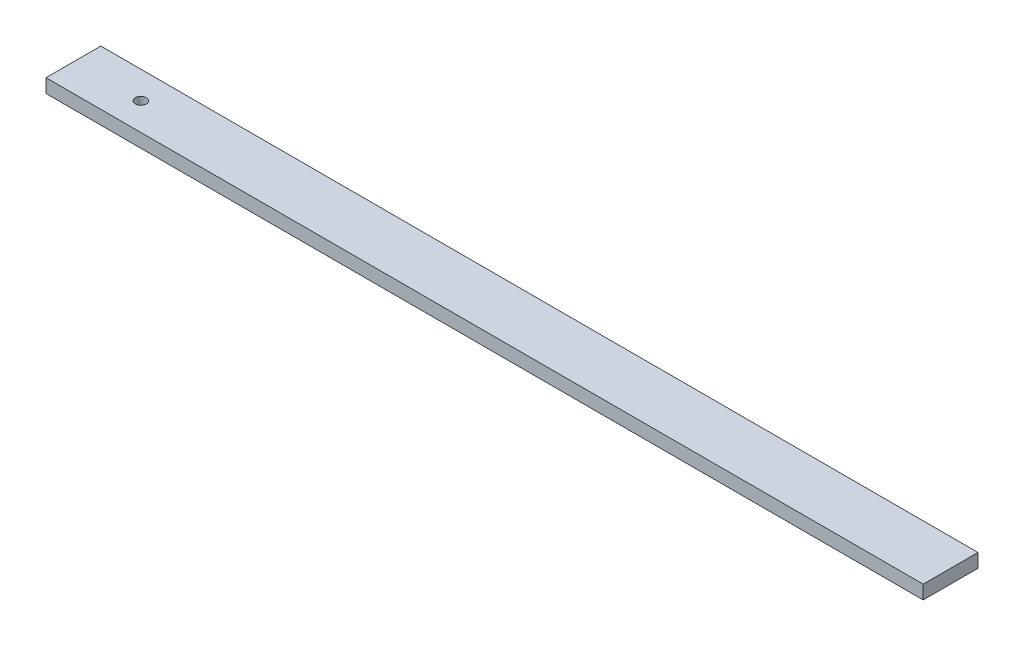
ISO-10303-21;
HEADER;
FILE_DESCRIPTION(('STEP AP214'),'2;1');
FILE_NAME('part.step','',(''),(''),'','','');
FILE_SCHEMA(('AUTOMOTIVE_DESIGN { 1 0 10303 214 1 1 1 1 }'));
ENDSEC;
DATA;
#1=APPLICATION_CONTEXT('core data for automotive mechanical design processes');
#2=APPLICATION_PROTOCOL_DEFINITION('international standard','automotive_design',2000,#1);
#3=PRODUCT_CONTEXT('',#1,'mechanical');
#4=PRODUCT('Part','Part','',(#3));
#5=PRODUCT_RELATED_PRODUCT_CATEGORY('part','',(#4));
#6=PRODUCT_DEFINITION_FORMATION('','',#4);
#7=PRODUCT_DEFINITION_CONTEXT('part definition',#1,'design');
#8=PRODUCT_DEFINITION('design','',#6,#7);
#9=PRODUCT_DEFINITION_SHAPE('','',#8);
#10=(LENGTH_UNIT() NAMED_UNIT(*) SI_UNIT(.MILLI.,.METRE.));
#11=(NAMED_UNIT(*) PLANE_ANGLE_UNIT() SI_UNIT($,.RADIAN.));
#12=(NAMED_UNIT(*) SI_UNIT($,.STERADIAN.) SOLID_ANGLE_UNIT());
#13=UNCERTAINTY_MEASURE_WITH_UNIT(LENGTH_MEASURE(1.E-05),#10,'distance_accuracy_value','');
#14=(GEOMETRIC_REPRESENTATION_CONTEXT(3) GLOBAL_UNCERTAINTY_ASSIGNED_CONTEXT((#13)) GLOBAL_UNIT_ASSIGNED_CONTEXT((#10,
#11,#12)) REPRESENTATION_CONTEXT('',''));
#15=CARTESIAN_POINT('',(0.,0.,0.));
#16=DIRECTION('',(0.,0.,1.));
#17=DIRECTION('',(1.,0.,0.));
#18=AXIS2_PLACEMENT_3D('',#15,#16,#17);
#19=CARTESIAN_POINT('',(211.2,-3.05,12.2));
#20=DIRECTION('',(0.,0.,-1.));
#21=DIRECTION('',(-1.,0.,0.));
#22=AXIS2_PLACEMENT_3D('',#19,#20,#21);
#23=PLANE('',#22);
#24=DIRECTION('',(0.,-1.,0.));
#25=VECTOR('',#24,1.);
#26=CARTESIAN_POINT('',(-195.2,-3.05,12.2));
#27=LINE('',#26,#25);
#28=CARTESIAN_POINT('',(-195.2,3.3,12.2));
#29=VERTEX_POINT('',#28);
#30=CARTESIAN_POINT('',(-195.2,-3.05,12.2));
#31=VERTEX_POINT('',#30);
#32=EDGE_CURVE('E97',#29,#31,#27,.T.);
#33=ORIENTED_EDGE('',*,*,#32,.T.);
#34=DIRECTION('',(-1.,0.,0.));
#35=VECTOR('',#34,1.);
#36=CARTESIAN_POINT('',(211.2,-3.05,12.2));
#37=LINE('',#36,#35);
#38=CARTESIAN_POINT('',(211.2,-3.05,12.2));
#39=VERTEX_POINT('',#38);
#40=EDGE_CURVE('E11',#39,#31,#37,.T.);
#41=ORIENTED_EDGE('',*,*,#40,.F.);
#42=DIRECTION('',(0.,-1.,0.));
#43=VECTOR('',#42,1.);
#44=CARTESIAN_POINT('',(211.2,-3.05,12.2));
#45=LINE('',#44,#43);
#46=CARTESIAN_POINT('',(211.2,3.3,12.2));
#47=VERTEX_POINT('',#46);
#48=EDGE_CURVE('E85',#47,#39,#45,.T.);
#49=ORIENTED_EDGE('',*,*,#48,.F.);
#50=DIRECTION('',(-1.,0.,0.));
#51=VECTOR('',#50,1.);
#52=CARTESIAN_POINT('',(211.2,3.3,12.2));
#53=LINE('',#52,#51);
#54=EDGE_CURVE('E93',#47,#29,#53,.T.);
#55=ORIENTED_EDGE('',*,*,#54,.T.);
#56=EDGE_LOOP('',(#33,#41,#49,#55));
#57=FACE_BOUND('',#56,.T.);
#58=ADVANCED_FACE('F34',(#57),#23,.F.);
#59=CARTESIAN_POINT('',(211.2,-3.05,12.2));
#60=DIRECTION('',(0.,1.,0.));
#61=DIRECTION('',(0.,0.,1.));
#62=AXIS2_PLACEMENT_3D('',#59,#60,#61);
#63=PLANE('',#62);
#64=CARTESIAN_POINT('',(-163.958,-3.05,-0.5));
#65=DIRECTION('',(0.,1.,0.));
#66=DIRECTION('',(0.,0.,1.));
#67=AXIS2_PLACEMENT_3D('',#64,#65,#66);
#68=CIRCLE('',#67,2.53999999999998);
#69=CARTESIAN_POINT('',(-163.958,-3.05,2.03999999999998));
#70=VERTEX_POINT('',#69);
#71=EDGE_CURVE('E100',#70,#70,#68,.T.);
#72=ORIENTED_EDGE('',*,*,#71,.T.);
#73=EDGE_LOOP('',(#72));
#74=FACE_BOUND('',#73,.T.);
#75=DIRECTION('',(0.,0.,-1.));
#76=VECTOR('',#75,1.);
#77=CARTESIAN_POINT('',(-195.2,-3.05,12.2));
#78=LINE('',#77,#76);
#79=CARTESIAN_POINT('',(-195.2,-3.05,-13.2));
#80=VERTEX_POINT('',#79);
#81=EDGE_CURVE('E89',#31,#80,#78,.T.);
#82=ORIENTED_EDGE('',*,*,#81,.T.);
#83=DIRECTION('',(-1.,0.,0.));
#84=VECTOR('',#83,1.);
#85=CARTESIAN_POINT('',(211.2,-3.05,-13.2));
#86=LINE('',#85,#84);
#87=CARTESIAN_POINT('',(211.2,-3.05,-13.2));
#88=VERTEX_POINT('',#87);
#89=EDGE_CURVE('E42',#88,#80,#86,.T.);
#90=ORIENTED_EDGE('',*,*,#89,.F.);
#91=DIRECTION('',(0.,0.,-1.));
#92=VECTOR('',#91,1.);
#93=CARTESIAN_POINT('',(211.2,-3.05,12.2));
#94=LINE('',#93,#92);
#95=EDGE_CURVE('E80',#39,#88,#94,.T.);
#96=ORIENTED_EDGE('',*,*,#95,.F.);
#97=ORIENTED_EDGE('',*,*,#40,.T.);
#98=EDGE_LOOP('',(#82,#90,#96,#97));
#99=FACE_BOUND('',#98,.T.);
#100=ADVANCED_FACE('F88',(#74,#99),#63,.F.);
#101=CARTESIAN_POINT('',(211.2,-3.05,-13.2));
#102=DIRECTION('',(0.,0.,1.));
#103=DIRECTION('',(1.,0.,0.));
#104=AXIS2_PLACEMENT_3D('',#101,#102,#103);
#105=PLANE('',#104);
#106=DIRECTION('',(0.,1.,0.));
#107=VECTOR('',#106,1.);
#108=CARTESIAN_POINT('',(-195.2,-3.05,-13.2));
#109=LINE('',#108,#107);
#110=CARTESIAN_POINT('',(-195.2,3.3,-13.2));
#111=VERTEX_POINT('',#110);
#112=EDGE_CURVE('E67',#80,#111,#109,.T.);
#113=ORIENTED_EDGE('',*,*,#112,.T.);
#114=DIRECTION('',(-1.,0.,0.));
#115=VECTOR('',#114,1.);
#116=CARTESIAN_POINT('',(211.2,3.3,-13.2));
#117=LINE('',#116,#115);
#118=CARTESIAN_POINT('',(211.2,3.3,-13.2));
#119=VERTEX_POINT('',#118);
#120=EDGE_CURVE('E90',#119,#111,#117,.T.);
#121=ORIENTED_EDGE('',*,*,#120,.F.);
#122=DIRECTION('',(0.,1.,0.));
#123=VECTOR('',#122,1.);
#124=CARTESIAN_POINT('',(211.2,-3.05,-13.2));
#125=LINE('',#124,#123);
#126=EDGE_CURVE('E83',#88,#119,#125,.T.);
#127=ORIENTED_EDGE('',*,*,#126,.F.);
#128=ORIENTED_EDGE('',*,*,#89,.T.);
#129=EDGE_LOOP('',(#113,#121,#127,#128));
#130=FACE_BOUND('',#129,.T.);
#131=ADVANCED_FACE('F91',(#130),#105,.F.);
#132=CARTESIAN_POINT('',(211.2,3.3,12.2));
#133=DIRECTION('',(0.,-1.,0.));
#134=DIRECTION('',(0.,0.,-1.));
#135=AXIS2_PLACEMENT_3D('',#132,#133,#134);
#136=PLANE('',#135);
#137=CARTESIAN_POINT('',(-163.958,3.3,-0.5));
#138=DIRECTION('',(0.,1.,0.));
#139=DIRECTION('',(0.,0.,1.));
#140=AXIS2_PLACEMENT_3D('',#137,#138,#139);
#141=CIRCLE('',#140,2.53999999999998);
#142=CARTESIAN_POINT('',(-163.958,3.3,2.03999999999998));
#143=VERTEX_POINT('',#142);
#144=EDGE_CURVE('E111',#143,#143,#141,.T.);
#145=ORIENTED_EDGE('',*,*,#144,.F.);
#146=EDGE_LOOP('',(#145));
#147=FACE_BOUND('',#146,.T.);
#148=DIRECTION('',(0.,0.,1.));
#149=VECTOR('',#148,1.);
#150=CARTESIAN_POINT('',(-195.2,3.3,12.2));
#151=LINE('',#150,#149);
#152=EDGE_CURVE('E73',#111,#29,#151,.T.);
#153=ORIENTED_EDGE('',*,*,#152,.T.);
#154=ORIENTED_EDGE('',*,*,#54,.F.);
#155=DIRECTION('',(0.,0.,1.));
#156=VECTOR('',#155,1.);
#157=CARTESIAN_POINT('',(211.2,3.3,12.2));
#158=LINE('',#157,#156);
#159=EDGE_CURVE('E50',#119,#47,#158,.T.);
#160=ORIENTED_EDGE('',*,*,#159,.F.);
#161=ORIENTED_EDGE('',*,*,#120,.T.);
#162=EDGE_LOOP('',(#153,#154,#160,#161));
#163=FACE_BOUND('',#162,.T.);
#164=ADVANCED_FACE('F105',(#147,#163),#136,.F.);
#165=CARTESIAN_POINT('',(211.2,-3.05,12.2));
#166=DIRECTION('',(-1.,0.,0.));
#167=DIRECTION('',(0.,0.,1.));
#168=AXIS2_PLACEMENT_3D('',#165,#166,#167);
#169=PLANE('',#168);
#170=ORIENTED_EDGE('',*,*,#48,.T.);
#171=ORIENTED_EDGE('',*,*,#95,.T.);
#172=ORIENTED_EDGE('',*,*,#126,.T.);
#173=ORIENTED_EDGE('',*,*,#159,.T.);
#174=EDGE_LOOP('',(#170,#171,#172,#173));
#175=FACE_BOUND('',#174,.T.);
#176=ADVANCED_FACE('F81',(#175),#169,.F.);
#177=CARTESIAN_POINT('',(-195.2,-3.05,12.2));
#178=DIRECTION('',(-1.,0.,0.));
#179=DIRECTION('',(0.,0.,1.));
#180=AXIS2_PLACEMENT_3D('',#177,#178,#179);
#181=PLANE('',#180);
#182=ORIENTED_EDGE('',*,*,#32,.F.);
#183=ORIENTED_EDGE('',*,*,#152,.F.);
#184=ORIENTED_EDGE('',*,*,#112,.F.);
#185=ORIENTED_EDGE('',*,*,#81,.F.);
#186=EDGE_LOOP('',(#182,#183,#184,#185));
#187=FACE_BOUND('',#186,.T.);
#188=ADVANCED_FACE('F108',(#187),#181,.T.);
#189=CARTESIAN_POINT('',(-163.958,-3.05,-0.5));
#190=DIRECTION('',(0.,1.,0.));
#191=DIRECTION('',(0.,0.,1.));
#192=AXIS2_PLACEMENT_3D('',#189,#190,#191);
#193=CYLINDRICAL_SURFACE('',#192,2.53999999999998);
#194=ORIENTED_EDGE('',*,*,#71,.F.);
#195=EDGE_LOOP('',(#194));
#196=FACE_BOUND('',#195,.T.);
#197=ORIENTED_EDGE('',*,*,#144,.T.);
#198=EDGE_LOOP('',(#197));
#199=FACE_BOUND('',#198,.T.);
#200=ADVANCED_FACE('F118',(#196,#199),#193,.F.);
#201=CLOSED_SHELL('',(#58,#100,#131,#164,#176,#188,#200));
#202=MANIFOLD_SOLID_BREP('B2',#201);
#203=ADVANCED_BREP_SHAPE_REPRESENTATION('',(#18,#202),#14);
#204=SHAPE_DEFINITION_REPRESENTATION(#9,#203);
ENDSEC;
END-ISO-10303-21;
